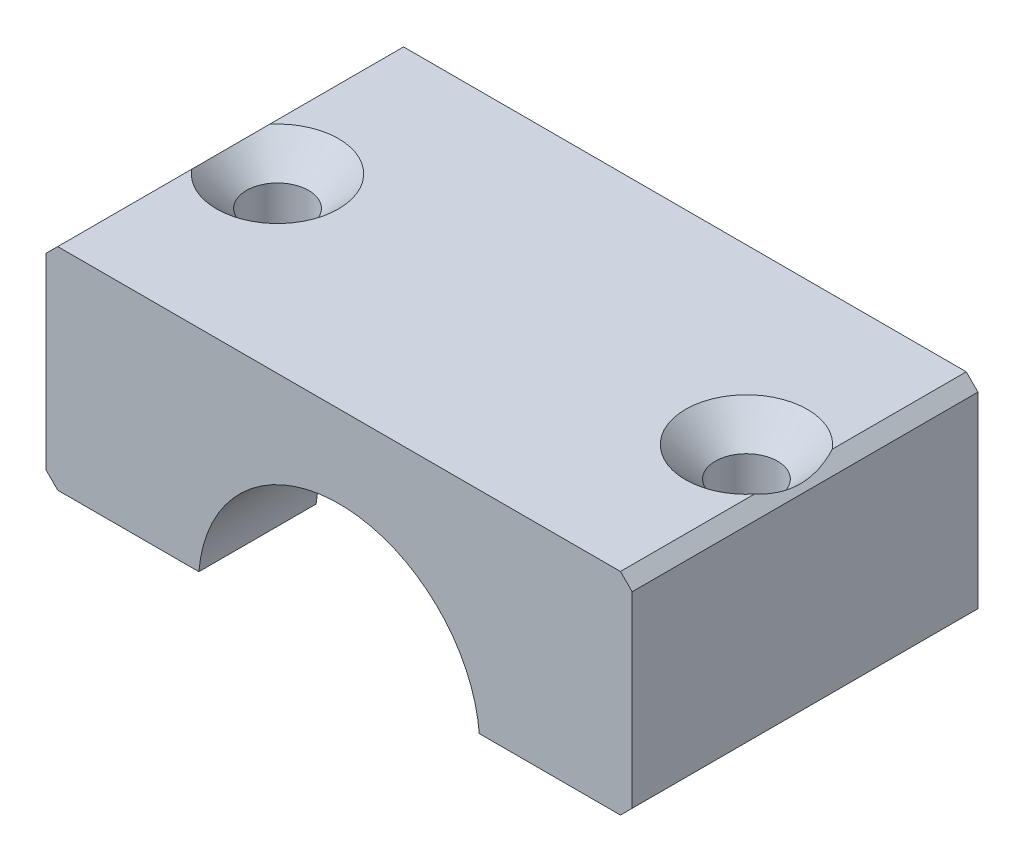
ISO-10303-21;
HEADER;
FILE_DESCRIPTION(('STEP AP214'),'2;1');
FILE_NAME('part.step','',(''),(''),'','','');
FILE_SCHEMA(('AUTOMOTIVE_DESIGN { 1 0 10303 214 1 1 1 1 }'));
ENDSEC;
DATA;
#1=APPLICATION_CONTEXT('core data for automotive mechanical design processes');
#2=APPLICATION_PROTOCOL_DEFINITION('international standard','automotive_design',2000,#1);
#3=PRODUCT_CONTEXT('',#1,'mechanical');
#4=PRODUCT('Part','Part','',(#3));
#5=PRODUCT_RELATED_PRODUCT_CATEGORY('part','',(#4));
#6=PRODUCT_DEFINITION_FORMATION('','',#4);
#7=PRODUCT_DEFINITION_CONTEXT('part definition',#1,'design');
#8=PRODUCT_DEFINITION('design','',#6,#7);
#9=PRODUCT_DEFINITION_SHAPE('','',#8);
#10=(LENGTH_UNIT() NAMED_UNIT(*) SI_UNIT(.MILLI.,.METRE.));
#11=(NAMED_UNIT(*) PLANE_ANGLE_UNIT() SI_UNIT($,.RADIAN.));
#12=(NAMED_UNIT(*) SI_UNIT($,.STERADIAN.) SOLID_ANGLE_UNIT());
#13=UNCERTAINTY_MEASURE_WITH_UNIT(LENGTH_MEASURE(1.E-05),#10,'distance_accuracy_value','');
#14=(GEOMETRIC_REPRESENTATION_CONTEXT(3) GLOBAL_UNCERTAINTY_ASSIGNED_CONTEXT((#13)) GLOBAL_UNIT_ASSIGNED_CONTEXT((#10,
#11,#12)) REPRESENTATION_CONTEXT('',''));
#15=CARTESIAN_POINT('',(0.,0.,0.));
#16=DIRECTION('',(0.,0.,1.));
#17=DIRECTION('',(1.,0.,0.));
#18=AXIS2_PLACEMENT_3D('',#15,#16,#17);
#19=CARTESIAN_POINT('',(-25.,19.,29.5));
#20=DIRECTION('',(0.,-1.,0.));
#21=DIRECTION('',(0.,0.,-1.));
#22=AXIS2_PLACEMENT_3D('',#19,#20,#21);
#23=PLANE('',#22);
#24=DIRECTION('',(0.,0.,1.));
#25=VECTOR('',#24,1.);
#26=CARTESIAN_POINT('',(-24.,19.,29.5));
#27=LINE('',#26,#25);
#28=CARTESIAN_POINT('',(-24.,19.,0.));
#29=VERTEX_POINT('',#28);
#30=CARTESIAN_POINT('',(-24.,19.,11.4273504548328));
#31=VERTEX_POINT('',#30);
#32=EDGE_CURVE('E162',#29,#31,#27,.T.);
#33=ORIENTED_EDGE('',*,*,#32,.T.);
#34=CARTESIAN_POINT('',(-20.,19.,14.75));
#35=DIRECTION('',(0.,1.,0.));
#36=DIRECTION('',(0.,0.,1.));
#37=AXIS2_PLACEMENT_3D('',#34,#35,#36);
#38=CIRCLE('',#37,5.2);
#39=CARTESIAN_POINT('',(-24.,19.,18.0726495451672));
#40=VERTEX_POINT('',#39);
#41=EDGE_CURVE('E55',#40,#31,#38,.T.);
#42=ORIENTED_EDGE('',*,*,#41,.F.);
#43=CARTESIAN_POINT('',(-24.,19.,29.5));
#44=VERTEX_POINT('',#43);
#45=EDGE_CURVE('E159',#40,#44,#27,.T.);
#46=ORIENTED_EDGE('',*,*,#45,.T.);
#47=DIRECTION('',(-1.,0.,0.));
#48=VECTOR('',#47,1.);
#49=CARTESIAN_POINT('',(-25.,19.,29.5));
#50=LINE('',#49,#48);
#51=CARTESIAN_POINT('',(24.,19.,29.5));
#52=VERTEX_POINT('',#51);
#53=EDGE_CURVE('E280',#52,#44,#50,.T.);
#54=ORIENTED_EDGE('',*,*,#53,.F.);
#55=DIRECTION('',(0.,0.,-1.));
#56=VECTOR('',#55,1.);
#57=CARTESIAN_POINT('',(24.,19.,29.5));
#58=LINE('',#57,#56);
#59=CARTESIAN_POINT('',(24.,19.,18.0726495451672));
#60=VERTEX_POINT('',#59);
#61=EDGE_CURVE('E169',#52,#60,#58,.T.);
#62=ORIENTED_EDGE('',*,*,#61,.T.);
#63=CARTESIAN_POINT('',(20.,19.,14.75));
#64=DIRECTION('',(0.,1.,0.));
#65=DIRECTION('',(0.,0.,1.));
#66=AXIS2_PLACEMENT_3D('',#63,#64,#65);
#67=CIRCLE('',#66,5.2);
#68=CARTESIAN_POINT('',(24.,19.,11.4273504548328));
#69=VERTEX_POINT('',#68);
#70=EDGE_CURVE('E62',#69,#60,#67,.T.);
#71=ORIENTED_EDGE('',*,*,#70,.F.);
#72=CARTESIAN_POINT('',(24.,19.,0.));
#73=VERTEX_POINT('',#72);
#74=EDGE_CURVE('E173',#69,#73,#58,.T.);
#75=ORIENTED_EDGE('',*,*,#74,.T.);
#76=DIRECTION('',(-1.,0.,0.));
#77=VECTOR('',#76,1.);
#78=CARTESIAN_POINT('',(-25.,19.,0.));
#79=LINE('',#78,#77);
#80=EDGE_CURVE('E303',#73,#29,#79,.T.);
#81=ORIENTED_EDGE('',*,*,#80,.T.);
#82=EDGE_LOOP('',(#33,#42,#46,#54,#62,#71,#75,#81));
#83=FACE_BOUND('',#82,.T.);
#84=ADVANCED_FACE('F36',(#83),#23,.F.);
#85=CARTESIAN_POINT('',(-25.,0.999999999999999,29.5));
#86=DIRECTION('',(0.,1.,0.));
#87=DIRECTION('',(-1.,0.,0.));
#88=AXIS2_PLACEMENT_3D('',#85,#86,#87);
#89=PLANE('',#88);
#90=CARTESIAN_POINT('',(-20.,1.,14.75));
#91=DIRECTION('',(0.,1.,0.));
#92=DIRECTION('',(0.,0.,1.));
#93=AXIS2_PLACEMENT_3D('',#90,#91,#92);
#94=CIRCLE('',#93,2.65);
#95=CARTESIAN_POINT('',(-20.,1.,17.4));
#96=VERTEX_POINT('',#95);
#97=EDGE_CURVE('E365',#96,#96,#94,.T.);
#98=ORIENTED_EDGE('',*,*,#97,.T.);
#99=EDGE_LOOP('',(#98));
#100=FACE_BOUND('',#99,.T.);
#101=DIRECTION('',(-1.,0.,0.));
#102=VECTOR('',#101,1.);
#103=CARTESIAN_POINT('',(-25.,0.999999999999999,19.5));
#104=LINE('',#103,#102);
#105=CARTESIAN_POINT('',(-11.9582607431014,1.,19.5));
#106=VERTEX_POINT('',#105);
#107=CARTESIAN_POINT('',(-14.9666295470958,1.,19.5));
#108=VERTEX_POINT('',#107);
#109=EDGE_CURVE('E292',#106,#108,#104,.T.);
#110=ORIENTED_EDGE('',*,*,#109,.F.);
#111=DIRECTION('',(0.,0.,-1.));
#112=VECTOR('',#111,1.);
#113=CARTESIAN_POINT('',(-11.9582607431014,1.,29.5));
#114=LINE('',#113,#112);
#115=CARTESIAN_POINT('',(-11.9582607431014,1.,29.5));
#116=VERTEX_POINT('',#115);
#117=EDGE_CURVE('E310',#116,#106,#114,.T.);
#118=ORIENTED_EDGE('',*,*,#117,.F.);
#119=DIRECTION('',(1.,0.,0.));
#120=VECTOR('',#119,1.);
#121=CARTESIAN_POINT('',(-25.,0.999999999999999,29.5));
#122=LINE('',#121,#120);
#123=CARTESIAN_POINT('',(-24.,0.999999999999999,29.5));
#124=VERTEX_POINT('',#123);
#125=EDGE_CURVE('E335',#124,#116,#122,.T.);
#126=ORIENTED_EDGE('',*,*,#125,.F.);
#127=DIRECTION('',(0.,0.,-1.));
#128=VECTOR('',#127,1.);
#129=CARTESIAN_POINT('',(-24.,0.999999999999999,29.5));
#130=LINE('',#129,#128);
#131=CARTESIAN_POINT('',(-24.,0.999999999999999,0.));
#132=VERTEX_POINT('',#131);
#133=EDGE_CURVE('E183',#124,#132,#130,.T.);
#134=ORIENTED_EDGE('',*,*,#133,.T.);
#135=DIRECTION('',(1.,0.,0.));
#136=VECTOR('',#135,1.);
#137=CARTESIAN_POINT('',(-25.,0.999999999999999,0.));
#138=LINE('',#137,#136);
#139=CARTESIAN_POINT('',(-11.9582607431014,1.,0.));
#140=VERTEX_POINT('',#139);
#141=EDGE_CURVE('E291',#132,#140,#138,.T.);
#142=ORIENTED_EDGE('',*,*,#141,.T.);
#143=CARTESIAN_POINT('',(-11.9582607431014,1.,10.));
#144=VERTEX_POINT('',#143);
#145=EDGE_CURVE('E309',#144,#140,#114,.T.);
#146=ORIENTED_EDGE('',*,*,#145,.F.);
#147=DIRECTION('',(1.,0.,0.));
#148=VECTOR('',#147,1.);
#149=CARTESIAN_POINT('',(-25.,0.999999999999999,10.));
#150=LINE('',#149,#148);
#151=CARTESIAN_POINT('',(-14.9666295470958,1.,10.));
#152=VERTEX_POINT('',#151);
#153=EDGE_CURVE('E348',#152,#144,#150,.T.);
#154=ORIENTED_EDGE('',*,*,#153,.F.);
#155=DIRECTION('',(0.,0.,-1.));
#156=VECTOR('',#155,1.);
#157=CARTESIAN_POINT('',(-14.9666295470958,1.,0.));
#158=LINE('',#157,#156);
#159=EDGE_CURVE('E346',#108,#152,#158,.T.);
#160=ORIENTED_EDGE('',*,*,#159,.F.);
#161=EDGE_LOOP('',(#110,#118,#126,#134,#142,#146,#154,#160));
#162=FACE_BOUND('',#161,.T.);
#163=ADVANCED_FACE('F235',(#100,#162),#89,.F.);
#164=CARTESIAN_POINT('',(0.,0.,29.5));
#165=DIRECTION('',(0.,0.,-1.));
#166=DIRECTION('',(-1.,0.,0.));
#167=AXIS2_PLACEMENT_3D('',#164,#165,#166);
#168=CYLINDRICAL_SURFACE('',#167,12.);
#169=CARTESIAN_POINT('',(0.,0.,19.5));
#170=DIRECTION('',(0.,0.,-1.));
#171=DIRECTION('',(-1.,0.,0.));
#172=AXIS2_PLACEMENT_3D('',#169,#170,#171);
#173=CIRCLE('',#172,12.);
#174=CARTESIAN_POINT('',(11.9582607431014,1.,19.5));
#175=VERTEX_POINT('',#174);
#176=EDGE_CURVE('E344',#175,#106,#173,.F.);
#177=ORIENTED_EDGE('',*,*,#176,.F.);
#178=DIRECTION('',(0.,0.,-1.));
#179=VECTOR('',#178,1.);
#180=CARTESIAN_POINT('',(11.9582607431014,1.,29.5));
#181=LINE('',#180,#179);
#182=CARTESIAN_POINT('',(11.9582607431014,1.,29.5));
#183=VERTEX_POINT('',#182);
#184=EDGE_CURVE('E306',#183,#175,#181,.T.);
#185=ORIENTED_EDGE('',*,*,#184,.F.);
#186=CARTESIAN_POINT('',(0.,0.,29.5));
#187=DIRECTION('',(0.,0.,-1.));
#188=DIRECTION('',(1.,0.,0.));
#189=AXIS2_PLACEMENT_3D('',#186,#187,#188);
#190=CIRCLE('',#189,12.);
#191=EDGE_CURVE('E284',#116,#183,#190,.T.);
#192=ORIENTED_EDGE('',*,*,#191,.F.);
#193=ORIENTED_EDGE('',*,*,#117,.T.);
#194=EDGE_LOOP('',(#177,#185,#192,#193));
#195=FACE_BOUND('',#194,.T.);
#196=ADVANCED_FACE('F245',(#195),#168,.F.);
#197=CARTESIAN_POINT('',(0.,0.,10.));
#198=DIRECTION('',(0.,0.,1.));
#199=DIRECTION('',(1.,0.,0.));
#200=AXIS2_PLACEMENT_3D('',#197,#198,#199);
#201=CIRCLE('',#200,12.);
#202=CARTESIAN_POINT('',(11.9582607431014,1.,10.));
#203=VERTEX_POINT('',#202);
#204=EDGE_CURVE('E350',#144,#203,#201,.F.);
#205=ORIENTED_EDGE('',*,*,#204,.F.);
#206=ORIENTED_EDGE('',*,*,#145,.T.);
#207=CARTESIAN_POINT('',(0.,0.,0.));
#208=DIRECTION('',(0.,0.,-1.));
#209=DIRECTION('',(1.,0.,0.));
#210=AXIS2_PLACEMENT_3D('',#207,#208,#209);
#211=CIRCLE('',#210,12.);
#212=CARTESIAN_POINT('',(11.9582607431014,1.,0.));
#213=VERTEX_POINT('',#212);
#214=EDGE_CURVE('E295',#140,#213,#211,.T.);
#215=ORIENTED_EDGE('',*,*,#214,.T.);
#216=EDGE_CURVE('E282',#203,#213,#181,.T.);
#217=ORIENTED_EDGE('',*,*,#216,.F.);
#218=EDGE_LOOP('',(#205,#206,#215,#217));
#219=FACE_BOUND('',#218,.T.);
#220=ADVANCED_FACE('F243',(#219),#168,.F.);
#221=CARTESIAN_POINT('',(11.9582607431014,1.,29.5));
#222=DIRECTION('',(0.,1.,0.));
#223=DIRECTION('',(-1.,0.,0.));
#224=AXIS2_PLACEMENT_3D('',#221,#222,#223);
#225=PLANE('',#224);
#226=CARTESIAN_POINT('',(20.,1.,14.75));
#227=DIRECTION('',(0.,1.,0.));
#228=DIRECTION('',(0.,0.,1.));
#229=AXIS2_PLACEMENT_3D('',#226,#227,#228);
#230=CIRCLE('',#229,2.65);
#231=CARTESIAN_POINT('',(20.,1.,17.4));
#232=VERTEX_POINT('',#231);
#233=EDGE_CURVE('E358',#232,#232,#230,.T.);
#234=ORIENTED_EDGE('',*,*,#233,.T.);
#235=EDGE_LOOP('',(#234));
#236=FACE_BOUND('',#235,.T.);
#237=DIRECTION('',(-1.,0.,0.));
#238=VECTOR('',#237,1.);
#239=CARTESIAN_POINT('',(11.9582607431014,1.,19.5));
#240=LINE('',#239,#238);
#241=CARTESIAN_POINT('',(14.9666295470958,1.,19.5));
#242=VERTEX_POINT('',#241);
#243=EDGE_CURVE('E197',#242,#175,#240,.T.);
#244=ORIENTED_EDGE('',*,*,#243,.F.);
#245=DIRECTION('',(0.,0.,-1.));
#246=VECTOR('',#245,1.);
#247=CARTESIAN_POINT('',(14.9666295470958,1.,0.));
#248=LINE('',#247,#246);
#249=CARTESIAN_POINT('',(14.9666295470958,1.,10.));
#250=VERTEX_POINT('',#249);
#251=EDGE_CURVE('E195',#250,#242,#248,.F.);
#252=ORIENTED_EDGE('',*,*,#251,.F.);
#253=DIRECTION('',(1.,0.,0.));
#254=VECTOR('',#253,1.);
#255=CARTESIAN_POINT('',(11.9582607431014,1.,10.));
#256=LINE('',#255,#254);
#257=EDGE_CURVE('E193',#203,#250,#256,.T.);
#258=ORIENTED_EDGE('',*,*,#257,.F.);
#259=ORIENTED_EDGE('',*,*,#216,.T.);
#260=DIRECTION('',(1.,0.,0.));
#261=VECTOR('',#260,1.);
#262=CARTESIAN_POINT('',(11.9582607431014,1.,0.));
#263=LINE('',#262,#261);
#264=CARTESIAN_POINT('',(24.,0.999999999999999,0.));
#265=VERTEX_POINT('',#264);
#266=EDGE_CURVE('E298',#213,#265,#263,.T.);
#267=ORIENTED_EDGE('',*,*,#266,.T.);
#268=DIRECTION('',(0.,0.,1.));
#269=VECTOR('',#268,1.);
#270=CARTESIAN_POINT('',(24.,0.999999999999999,29.5));
#271=LINE('',#270,#269);
#272=CARTESIAN_POINT('',(24.,0.999999999999999,29.5));
#273=VERTEX_POINT('',#272);
#274=EDGE_CURVE('E191',#265,#273,#271,.T.);
#275=ORIENTED_EDGE('',*,*,#274,.T.);
#276=DIRECTION('',(1.,0.,0.));
#277=VECTOR('',#276,1.);
#278=CARTESIAN_POINT('',(11.9582607431014,1.,29.5));
#279=LINE('',#278,#277);
#280=EDGE_CURVE('E276',#183,#273,#279,.T.);
#281=ORIENTED_EDGE('',*,*,#280,.F.);
#282=ORIENTED_EDGE('',*,*,#184,.T.);
#283=EDGE_LOOP('',(#244,#252,#258,#259,#267,#275,#281,#282));
#284=FACE_BOUND('',#283,.T.);
#285=ADVANCED_FACE('F240',(#236,#284),#225,.F.);
#286=CARTESIAN_POINT('',(-25.,0.999999999999999,29.5));
#287=DIRECTION('',(1.,0.,0.));
#288=DIRECTION('',(0.,0.,-1.));
#289=AXIS2_PLACEMENT_3D('',#286,#287,#288);
#290=PLANE('',#289);
#291=DIRECTION('',(0.,-1.,0.));
#292=VECTOR('',#291,1.);
#293=CARTESIAN_POINT('',(-25.,0.999999999999999,29.5));
#294=LINE('',#293,#292);
#295=CARTESIAN_POINT('',(-25.,18.,29.5));
#296=VERTEX_POINT('',#295);
#297=CARTESIAN_POINT('',(-25.,2.00000000000001,29.5));
#298=VERTEX_POINT('',#297);
#299=EDGE_CURVE('E305',#296,#298,#294,.T.);
#300=ORIENTED_EDGE('',*,*,#299,.F.);
#301=DIRECTION('',(0.,0.,-1.));
#302=VECTOR('',#301,1.);
#303=CARTESIAN_POINT('',(-25.,18.,29.5));
#304=LINE('',#303,#302);
#305=CARTESIAN_POINT('',(-25.,18.,0.));
#306=VERTEX_POINT('',#305);
#307=EDGE_CURVE('E315',#296,#306,#304,.T.);
#308=ORIENTED_EDGE('',*,*,#307,.T.);
#309=DIRECTION('',(0.,-1.,0.));
#310=VECTOR('',#309,1.);
#311=CARTESIAN_POINT('',(-25.,0.999999999999999,0.));
#312=LINE('',#311,#310);
#313=CARTESIAN_POINT('',(-25.,2.00000000000001,0.));
#314=VERTEX_POINT('',#313);
#315=EDGE_CURVE('E288',#306,#314,#312,.T.);
#316=ORIENTED_EDGE('',*,*,#315,.T.);
#317=DIRECTION('',(0.,0.,1.));
#318=VECTOR('',#317,1.);
#319=CARTESIAN_POINT('',(-25.,2.00000000000001,29.5));
#320=LINE('',#319,#318);
#321=EDGE_CURVE('E313',#314,#298,#320,.T.);
#322=ORIENTED_EDGE('',*,*,#321,.T.);
#323=EDGE_LOOP('',(#300,#308,#316,#322));
#324=FACE_BOUND('',#323,.T.);
#325=ADVANCED_FACE('F238',(#324),#290,.F.);
#326=CARTESIAN_POINT('',(25.,0.999999999999999,29.5));
#327=DIRECTION('',(-1.,0.,0.));
#328=DIRECTION('',(0.,0.,1.));
#329=AXIS2_PLACEMENT_3D('',#326,#327,#328);
#330=PLANE('',#329);
#331=DIRECTION('',(0.,1.,0.));
#332=VECTOR('',#331,1.);
#333=CARTESIAN_POINT('',(25.,0.999999999999999,29.5));
#334=LINE('',#333,#332);
#335=CARTESIAN_POINT('',(25.,2.,29.5));
#336=VERTEX_POINT('',#335);
#337=CARTESIAN_POINT('',(25.,18.,29.5));
#338=VERTEX_POINT('',#337);
#339=EDGE_CURVE('E273',#336,#338,#334,.T.);
#340=ORIENTED_EDGE('',*,*,#339,.F.);
#341=DIRECTION('',(0.,0.,-1.));
#342=VECTOR('',#341,1.);
#343=CARTESIAN_POINT('',(25.,2.,29.5));
#344=LINE('',#343,#342);
#345=CARTESIAN_POINT('',(25.,2.,0.));
#346=VERTEX_POINT('',#345);
#347=EDGE_CURVE('E188',#336,#346,#344,.T.);
#348=ORIENTED_EDGE('',*,*,#347,.T.);
#349=DIRECTION('',(0.,1.,0.));
#350=VECTOR('',#349,1.);
#351=CARTESIAN_POINT('',(25.,0.999999999999999,0.));
#352=LINE('',#351,#350);
#353=CARTESIAN_POINT('',(25.,18.,0.));
#354=VERTEX_POINT('',#353);
#355=EDGE_CURVE('E301',#346,#354,#352,.T.);
#356=ORIENTED_EDGE('',*,*,#355,.T.);
#357=DIRECTION('',(0.,0.,1.));
#358=VECTOR('',#357,1.);
#359=CARTESIAN_POINT('',(25.,18.,29.5));
#360=LINE('',#359,#358);
#361=EDGE_CURVE('E186',#354,#338,#360,.T.);
#362=ORIENTED_EDGE('',*,*,#361,.T.);
#363=EDGE_LOOP('',(#340,#348,#356,#362));
#364=FACE_BOUND('',#363,.T.);
#365=ADVANCED_FACE('F228',(#364),#330,.F.);
#366=CARTESIAN_POINT('',(0.,0.,29.5));
#367=DIRECTION('',(0.,0.,1.));
#368=DIRECTION('',(1.,0.,0.));
#369=AXIS2_PLACEMENT_3D('',#366,#367,#368);
#370=PLANE('',#369);
#371=ORIENTED_EDGE('',*,*,#53,.T.);
#372=DIRECTION('',(0.707106781186548,0.707106781186548,0.));
#373=VECTOR('',#372,1.);
#374=CARTESIAN_POINT('',(-21.5,21.5,29.5));
#375=LINE('',#374,#373);
#376=EDGE_CURVE('E168',#44,#296,#375,.F.);
#377=ORIENTED_EDGE('',*,*,#376,.T.);
#378=ORIENTED_EDGE('',*,*,#299,.T.);
#379=DIRECTION('',(-0.707106781186548,0.707106781186547,0.));
#380=VECTOR('',#379,1.);
#381=CARTESIAN_POINT('',(-11.5,-11.5,29.5));
#382=LINE('',#381,#380);
#383=EDGE_CURVE('E180',#298,#124,#382,.F.);
#384=ORIENTED_EDGE('',*,*,#383,.T.);
#385=ORIENTED_EDGE('',*,*,#125,.T.);
#386=ORIENTED_EDGE('',*,*,#191,.T.);
#387=ORIENTED_EDGE('',*,*,#280,.T.);
#388=DIRECTION('',(-0.707106781186548,-0.707106781186547,0.));
#389=VECTOR('',#388,1.);
#390=CARTESIAN_POINT('',(11.5,-11.5,29.5));
#391=LINE('',#390,#389);
#392=EDGE_CURVE('E178',#273,#336,#391,.F.);
#393=ORIENTED_EDGE('',*,*,#392,.T.);
#394=ORIENTED_EDGE('',*,*,#339,.T.);
#395=DIRECTION('',(0.707106781186548,-0.707106781186548,0.));
#396=VECTOR('',#395,1.);
#397=CARTESIAN_POINT('',(21.5,21.5,29.5));
#398=LINE('',#397,#396);
#399=EDGE_CURVE('E171',#338,#52,#398,.F.);
#400=ORIENTED_EDGE('',*,*,#399,.T.);
#401=EDGE_LOOP('',(#371,#377,#378,#384,#385,#386,#387,#393,#394,#400));
#402=FACE_BOUND('',#401,.T.);
#403=ADVANCED_FACE('F224',(#402),#370,.T.);
#404=CARTESIAN_POINT('',(0.,0.,0.));
#405=DIRECTION('',(0.,0.,1.));
#406=DIRECTION('',(1.,0.,0.));
#407=AXIS2_PLACEMENT_3D('',#404,#405,#406);
#408=PLANE('',#407);
#409=ORIENTED_EDGE('',*,*,#315,.F.);
#410=DIRECTION('',(-0.707106781186548,-0.707106781186548,0.));
#411=VECTOR('',#410,1.);
#412=CARTESIAN_POINT('',(-25.,18.,0.));
#413=LINE('',#412,#411);
#414=EDGE_CURVE('E323',#306,#29,#413,.F.);
#415=ORIENTED_EDGE('',*,*,#414,.T.);
#416=ORIENTED_EDGE('',*,*,#80,.F.);
#417=DIRECTION('',(-0.707106781186548,0.707106781186548,0.));
#418=VECTOR('',#417,1.);
#419=CARTESIAN_POINT('',(24.,19.,0.));
#420=LINE('',#419,#418);
#421=EDGE_CURVE('E318',#73,#354,#420,.F.);
#422=ORIENTED_EDGE('',*,*,#421,.T.);
#423=ORIENTED_EDGE('',*,*,#355,.F.);
#424=DIRECTION('',(0.707106781186548,0.707106781186547,0.));
#425=VECTOR('',#424,1.);
#426=CARTESIAN_POINT('',(25.,2.,0.));
#427=LINE('',#426,#425);
#428=EDGE_CURVE('E320',#346,#265,#427,.F.);
#429=ORIENTED_EDGE('',*,*,#428,.T.);
#430=ORIENTED_EDGE('',*,*,#266,.F.);
#431=ORIENTED_EDGE('',*,*,#214,.F.);
#432=ORIENTED_EDGE('',*,*,#141,.F.);
#433=DIRECTION('',(0.707106781186548,-0.707106781186547,0.));
#434=VECTOR('',#433,1.);
#435=CARTESIAN_POINT('',(-24.,0.999999999999999,0.));
#436=LINE('',#435,#434);
#437=EDGE_CURVE('E322',#132,#314,#436,.F.);
#438=ORIENTED_EDGE('',*,*,#437,.T.);
#439=EDGE_LOOP('',(#409,#415,#416,#422,#423,#429,#430,#431,#432,#438));
#440=FACE_BOUND('',#439,.T.);
#441=ADVANCED_FACE('F227',(#440),#408,.F.);
#442=CARTESIAN_POINT('',(-25.,18.,29.5));
#443=DIRECTION('',(0.707106781186547,-0.707106781186547,0.));
#444=DIRECTION('',(0.,0.,-1.));
#445=AXIS2_PLACEMENT_3D('',#442,#443,#444);
#446=PLANE('',#445);
#447=CARTESIAN_POINT('',(-23.9998,19.0002,11.4267967260488));
#448=CARTESIAN_POINT('',(-24.0738793690361,18.9261206309639,11.6317886300289));
#449=CARTESIAN_POINT('',(-24.1425317829403,18.8574682170597,11.8409023051088));
#450=CARTESIAN_POINT('',(-24.2673630869593,18.7326369130407,12.2668932884788));
#451=CARTESIAN_POINT('',(-24.3235176030809,18.6764823969191,12.4837848258802));
#452=CARTESIAN_POINT('',(-24.4211803711222,18.5788196288778,12.9229138406442));
#453=CARTESIAN_POINT('',(-24.4627628509931,18.5372371490069,13.1451178780632));
#454=CARTESIAN_POINT('',(-24.5301250270952,18.4698749729048,13.5941347269912));
#455=CARTESIAN_POINT('',(-24.5559169648024,18.4440830351976,13.8209438271665));
#456=CARTESIAN_POINT('',(-24.5895375208206,18.4104624791794,14.2621945611706));
#457=CARTESIAN_POINT('',(-24.5984319048694,18.4015680951306,14.4764734077374));
#458=CARTESIAN_POINT('',(-24.601188081463,18.398811918537,14.9052705041029));
#459=CARTESIAN_POINT('',(-24.5950469894216,18.4049530105784,15.1197887919469));
#460=CARTESIAN_POINT('',(-24.567966807453,18.432033192547,15.5468698026072));
#461=CARTESIAN_POINT('',(-24.5470321536535,18.4529678463465,15.7594330923144));
#462=CARTESIAN_POINT('',(-24.4911619083291,18.5088380916709,16.18074282427));
#463=CARTESIAN_POINT('',(-24.4562294701168,18.5437705298832,16.3894901150904));
#464=CARTESIAN_POINT('',(-24.3635799322258,18.6364200677742,16.8512904464696));
#465=CARTESIAN_POINT('',(-24.3024080825976,18.6975919174024,17.1029665570343));
#466=CARTESIAN_POINT('',(-24.1979132447671,18.8020867552329,17.4727939392366));
#467=CARTESIAN_POINT('',(-24.1609971025742,18.8390028974258,17.5946840449753));
#468=CARTESIAN_POINT('',(-24.0832534616484,18.9167465383516,17.8358791037784));
#469=CARTESIAN_POINT('',(-24.0424277695262,18.9575722304738,17.9551852199549));
#470=CARTESIAN_POINT('',(-23.9998,19.0002,18.0732032739512));
#471=B_SPLINE_CURVE_WITH_KNOTS('',3,(#447,#448,#449,#450,#451,#452,#453,#454,#455,#456,#457,
#458,#459,#460,#461,#462,#463,#464,#465,#466,#467,#468,#469,#470),.UNSPECIFIED.,.F.,.F.,(4,2,2,
2,2,2,2,2,2,2,2,4),(0.,0.690738207229885,1.3828119450355,2.07130728207736,2.75926819118247,
3.40217604850192,4.04520725864357,4.68804572555833,5.33073946013987,6.12752392700586,
6.52521237186748,6.9227179228733),.UNSPECIFIED.);
#472=EDGE_CURVE('E11',#31,#40,#471,.T.);
#473=ORIENTED_EDGE('',*,*,#472,.F.);
#474=ORIENTED_EDGE('',*,*,#32,.F.);
#475=ORIENTED_EDGE('',*,*,#414,.F.);
#476=ORIENTED_EDGE('',*,*,#307,.F.);
#477=ORIENTED_EDGE('',*,*,#376,.F.);
#478=ORIENTED_EDGE('',*,*,#45,.F.);
#479=EDGE_LOOP('',(#473,#474,#475,#476,#477,#478));
#480=FACE_BOUND('',#479,.T.);
#481=ADVANCED_FACE('F166',(#480),#446,.F.);
#482=CARTESIAN_POINT('',(-24.,0.999999999999999,29.5));
#483=DIRECTION('',(0.707106781186547,0.707106781186548,0.));
#484=DIRECTION('',(0.,0.,-1.));
#485=AXIS2_PLACEMENT_3D('',#482,#483,#484);
#486=PLANE('',#485);
#487=ORIENTED_EDGE('',*,*,#383,.F.);
#488=ORIENTED_EDGE('',*,*,#321,.F.);
#489=ORIENTED_EDGE('',*,*,#437,.F.);
#490=ORIENTED_EDGE('',*,*,#133,.F.);
#491=EDGE_LOOP('',(#487,#488,#489,#490));
#492=FACE_BOUND('',#491,.T.);
#493=ADVANCED_FACE('F257',(#492),#486,.F.);
#494=CARTESIAN_POINT('',(25.,2.,29.5));
#495=DIRECTION('',(-0.707106781186547,0.707106781186548,0.));
#496=DIRECTION('',(0.,0.,-1.));
#497=AXIS2_PLACEMENT_3D('',#494,#495,#496);
#498=PLANE('',#497);
#499=ORIENTED_EDGE('',*,*,#392,.F.);
#500=ORIENTED_EDGE('',*,*,#274,.F.);
#501=ORIENTED_EDGE('',*,*,#428,.F.);
#502=ORIENTED_EDGE('',*,*,#347,.F.);
#503=EDGE_LOOP('',(#499,#500,#501,#502));
#504=FACE_BOUND('',#503,.T.);
#505=ADVANCED_FACE('F259',(#504),#498,.F.);
#506=CARTESIAN_POINT('',(24.,19.,29.5));
#507=DIRECTION('',(-0.707106781186547,-0.707106781186547,0.));
#508=DIRECTION('',(0.,0.,-1.));
#509=AXIS2_PLACEMENT_3D('',#506,#507,#508);
#510=PLANE('',#509);
#511=CARTESIAN_POINT('',(23.9998,19.0002,18.0732032739512));
#512=CARTESIAN_POINT('',(24.0738793690361,18.9261206309639,17.8682113699711));
#513=CARTESIAN_POINT('',(24.1425317829403,18.8574682170597,17.6590976948913));
#514=CARTESIAN_POINT('',(24.2673630869593,18.7326369130407,17.2331067115213));
#515=CARTESIAN_POINT('',(24.3235176030809,18.6764823969191,17.0162151741198));
#516=CARTESIAN_POINT('',(24.4211803711222,18.5788196288778,16.5770861593558));
#517=CARTESIAN_POINT('',(24.4627628509931,18.5372371490069,16.3548821219369));
#518=CARTESIAN_POINT('',(24.5301250270952,18.4698749729048,15.9058652730088));
#519=CARTESIAN_POINT('',(24.5559169648024,18.4440830351976,15.6790561728335));
#520=CARTESIAN_POINT('',(24.5895375208206,18.4104624791794,15.2378054388295));
#521=CARTESIAN_POINT('',(24.5984319048694,18.4015680951306,15.0235265922626));
#522=CARTESIAN_POINT('',(24.601188081463,18.398811918537,14.5947294958971));
#523=CARTESIAN_POINT('',(24.5950469894216,18.4049530105784,14.3802112080531));
#524=CARTESIAN_POINT('',(24.567966807453,18.432033192547,13.9531301973928));
#525=CARTESIAN_POINT('',(24.5470321536535,18.4529678463465,13.7405669076857));
#526=CARTESIAN_POINT('',(24.4911619083291,18.5088380916709,13.31925717573));
#527=CARTESIAN_POINT('',(24.4562294701168,18.5437705298832,13.1105098849096));
#528=CARTESIAN_POINT('',(24.3635799322258,18.6364200677742,12.6487095535304));
#529=CARTESIAN_POINT('',(24.3024080825976,18.6975919174024,12.3970334429657));
#530=CARTESIAN_POINT('',(24.1979132447671,18.8020867552329,12.0272060607633));
#531=CARTESIAN_POINT('',(24.1609971025742,18.8390028974258,11.9053159550247));
#532=CARTESIAN_POINT('',(24.0832534616484,18.9167465383516,11.6641208962216));
#533=CARTESIAN_POINT('',(24.0424277695262,18.9575722304738,11.5448147800451));
#534=CARTESIAN_POINT('',(23.9998,19.0002,11.4267967260488));
#535=B_SPLINE_CURVE_WITH_KNOTS('',3,(#511,#512,#513,#514,#515,#516,#517,#518,#519,#520,#521,
#522,#523,#524,#525,#526,#527,#528,#529,#530,#531,#532,#533,#534),.UNSPECIFIED.,.F.,.F.,(4,2,2,
2,2,2,2,2,2,2,2,4),(0.,0.690738207229888,1.38281194503551,2.07130728207738,2.75926819118248,
3.40217604850194,4.04520725864359,4.68804572555836,5.3307394601399,6.12752392700592,
6.52521237186754,6.92271792287338),.UNSPECIFIED.);
#536=EDGE_CURVE('E50',#60,#69,#535,.T.);
#537=ORIENTED_EDGE('',*,*,#536,.F.);
#538=ORIENTED_EDGE('',*,*,#61,.F.);
#539=ORIENTED_EDGE('',*,*,#399,.F.);
#540=ORIENTED_EDGE('',*,*,#361,.F.);
#541=ORIENTED_EDGE('',*,*,#421,.F.);
#542=ORIENTED_EDGE('',*,*,#74,.F.);
#543=EDGE_LOOP('',(#537,#538,#539,#540,#541,#542));
#544=FACE_BOUND('',#543,.T.);
#545=ADVANCED_FACE('F38',(#544),#510,.F.);
#546=CARTESIAN_POINT('',(-4.20942214961259,0.,19.5));
#547=DIRECTION('',(0.,0.,-1.));
#548=DIRECTION('',(-1.,0.,0.));
#549=AXIS2_PLACEMENT_3D('',#546,#547,#548);
#550=PLANE('',#549);
#551=ORIENTED_EDGE('',*,*,#109,.T.);
#552=CARTESIAN_POINT('',(0.,0.,19.5));
#553=DIRECTION('',(0.,0.,-1.));
#554=DIRECTION('',(-1.,0.,0.));
#555=AXIS2_PLACEMENT_3D('',#552,#553,#554);
#556=CIRCLE('',#555,15.);
#557=EDGE_CURVE('E352',#108,#242,#556,.T.);
#558=ORIENTED_EDGE('',*,*,#557,.T.);
#559=ORIENTED_EDGE('',*,*,#243,.T.);
#560=ORIENTED_EDGE('',*,*,#176,.T.);
#561=EDGE_LOOP('',(#551,#558,#559,#560));
#562=FACE_BOUND('',#561,.T.);
#563=ADVANCED_FACE('F219',(#562),#550,.T.);
#564=CARTESIAN_POINT('',(0.,0.,0.));
#565=DIRECTION('',(0.,0.,-1.));
#566=DIRECTION('',(-1.,0.,0.));
#567=AXIS2_PLACEMENT_3D('',#564,#565,#566);
#568=CYLINDRICAL_SURFACE('',#567,15.);
#569=ORIENTED_EDGE('',*,*,#159,.T.);
#570=CARTESIAN_POINT('',(0.,0.,10.));
#571=DIRECTION('',(0.,0.,-1.));
#572=DIRECTION('',(-1.,0.,0.));
#573=AXIS2_PLACEMENT_3D('',#570,#571,#572);
#574=CIRCLE('',#573,15.);
#575=EDGE_CURVE('E355',#152,#250,#574,.T.);
#576=ORIENTED_EDGE('',*,*,#575,.T.);
#577=ORIENTED_EDGE('',*,*,#251,.T.);
#578=ORIENTED_EDGE('',*,*,#557,.F.);
#579=EDGE_LOOP('',(#569,#576,#577,#578));
#580=FACE_BOUND('',#579,.T.);
#581=ADVANCED_FACE('F215',(#580),#568,.F.);
#582=CARTESIAN_POINT('',(-4.20942214961259,0.,10.));
#583=DIRECTION('',(0.,0.,1.));
#584=DIRECTION('',(1.,0.,0.));
#585=AXIS2_PLACEMENT_3D('',#582,#583,#584);
#586=PLANE('',#585);
#587=ORIENTED_EDGE('',*,*,#153,.T.);
#588=ORIENTED_EDGE('',*,*,#204,.T.);
#589=ORIENTED_EDGE('',*,*,#257,.T.);
#590=ORIENTED_EDGE('',*,*,#575,.F.);
#591=EDGE_LOOP('',(#587,#588,#589,#590));
#592=FACE_BOUND('',#591,.T.);
#593=ADVANCED_FACE('F211',(#592),#586,.T.);
#594=CARTESIAN_POINT('',(20.,19.,14.75));
#595=DIRECTION('',(0.,1.,0.));
#596=DIRECTION('',(0.,0.,1.));
#597=AXIS2_PLACEMENT_3D('',#594,#595,#596);
#598=CYLINDRICAL_SURFACE('',#597,2.65);
#599=ORIENTED_EDGE('',*,*,#233,.F.);
#600=EDGE_LOOP('',(#599));
#601=FACE_BOUND('',#600,.T.);
#602=CARTESIAN_POINT('',(20.,16.45,14.75));
#603=DIRECTION('',(0.,1.,0.));
#604=DIRECTION('',(0.,0.,1.));
#605=AXIS2_PLACEMENT_3D('',#602,#603,#604);
#606=CIRCLE('',#605,2.65);
#607=CARTESIAN_POINT('',(20.,16.45,17.4));
#608=VERTEX_POINT('',#607);
#609=EDGE_CURVE('E361',#608,#608,#606,.T.);
#610=ORIENTED_EDGE('',*,*,#609,.T.);
#611=EDGE_LOOP('',(#610));
#612=FACE_BOUND('',#611,.T.);
#613=ADVANCED_FACE('F208',(#601,#612),#598,.F.);
#614=CARTESIAN_POINT('',(20.,19.,14.75));
#615=DIRECTION('',(0.,1.,0.));
#616=DIRECTION('',(0.,0.,1.));
#617=AXIS2_PLACEMENT_3D('',#614,#615,#616);
#618=CONICAL_SURFACE('',#617,5.2,0.785398163397448);
#619=ORIENTED_EDGE('',*,*,#536,.T.);
#620=ORIENTED_EDGE('',*,*,#70,.T.);
#621=EDGE_LOOP('',(#619,#620));
#622=FACE_BOUND('',#621,.T.);
#623=ORIENTED_EDGE('',*,*,#609,.F.);
#624=EDGE_LOOP('',(#623));
#625=FACE_BOUND('',#624,.T.);
#626=ADVANCED_FACE('F202',(#622,#625),#618,.F.);
#627=CARTESIAN_POINT('',(-20.,19.,14.75));
#628=DIRECTION('',(0.,1.,0.));
#629=DIRECTION('',(0.,0.,1.));
#630=AXIS2_PLACEMENT_3D('',#627,#628,#629);
#631=CYLINDRICAL_SURFACE('',#630,2.65);
#632=ORIENTED_EDGE('',*,*,#97,.F.);
#633=EDGE_LOOP('',(#632));
#634=FACE_BOUND('',#633,.T.);
#635=CARTESIAN_POINT('',(-20.,16.45,14.75));
#636=DIRECTION('',(0.,1.,0.));
#637=DIRECTION('',(0.,0.,1.));
#638=AXIS2_PLACEMENT_3D('',#635,#636,#637);
#639=CIRCLE('',#638,2.65);
#640=CARTESIAN_POINT('',(-20.,16.45,17.4));
#641=VERTEX_POINT('',#640);
#642=EDGE_CURVE('E163',#641,#641,#639,.T.);
#643=ORIENTED_EDGE('',*,*,#642,.T.);
#644=EDGE_LOOP('',(#643));
#645=FACE_BOUND('',#644,.T.);
#646=ADVANCED_FACE('F207',(#634,#645),#631,.F.);
#647=CARTESIAN_POINT('',(-20.,19.,14.75));
#648=DIRECTION('',(0.,1.,0.));
#649=DIRECTION('',(0.,0.,1.));
#650=AXIS2_PLACEMENT_3D('',#647,#648,#649);
#651=CONICAL_SURFACE('',#650,5.2,0.785398163397448);
#652=ORIENTED_EDGE('',*,*,#472,.T.);
#653=ORIENTED_EDGE('',*,*,#41,.T.);
#654=EDGE_LOOP('',(#652,#653));
#655=FACE_BOUND('',#654,.T.);
#656=ORIENTED_EDGE('',*,*,#642,.F.);
#657=EDGE_LOOP('',(#656));
#658=FACE_BOUND('',#657,.T.);
#659=ADVANCED_FACE('F151',(#655,#658),#651,.F.);
#660=CLOSED_SHELL('',(#84,#163,#196,#220,#285,#325,#365,#403,#441,#481,#493,#505,#545,#563,#581,
#593,#613,#626,#646,#659));
#661=MANIFOLD_SOLID_BREP('B2',#660);
#662=ADVANCED_BREP_SHAPE_REPRESENTATION('',(#18,#661),#14);
#663=SHAPE_DEFINITION_REPRESENTATION(#9,#662);
ENDSEC;
END-ISO-10303-21;
